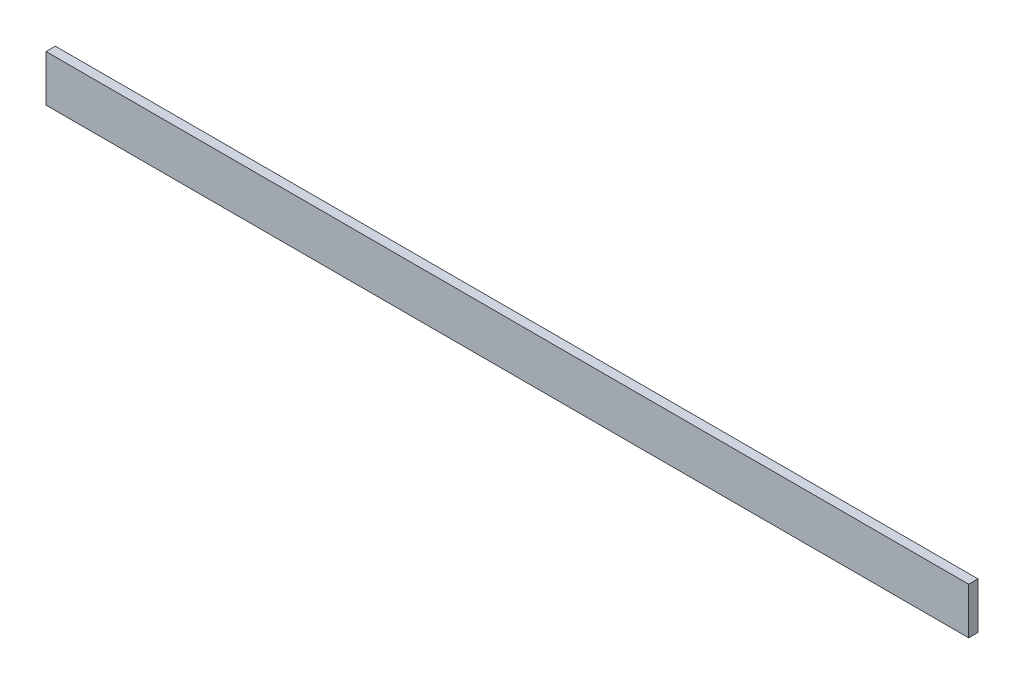
ISO-10303-21;
HEADER;
FILE_DESCRIPTION(('STEP AP214'),'2;1');
FILE_NAME('part.step','',(''),(''),'','','');
FILE_SCHEMA(('AUTOMOTIVE_DESIGN { 1 0 10303 214 1 1 1 1 }'));
ENDSEC;
DATA;
#1=APPLICATION_CONTEXT('core data for automotive mechanical design processes');
#2=APPLICATION_PROTOCOL_DEFINITION('international standard','automotive_design',2000,#1);
#3=PRODUCT_CONTEXT('',#1,'mechanical');
#4=PRODUCT('Part','Part','',(#3));
#5=PRODUCT_RELATED_PRODUCT_CATEGORY('part','',(#4));
#6=PRODUCT_DEFINITION_FORMATION('','',#4);
#7=PRODUCT_DEFINITION_CONTEXT('part definition',#1,'design');
#8=PRODUCT_DEFINITION('design','',#6,#7);
#9=PRODUCT_DEFINITION_SHAPE('','',#8);
#10=(LENGTH_UNIT() NAMED_UNIT(*) SI_UNIT(.MILLI.,.METRE.));
#11=(NAMED_UNIT(*) PLANE_ANGLE_UNIT() SI_UNIT($,.RADIAN.));
#12=(NAMED_UNIT(*) SI_UNIT($,.STERADIAN.) SOLID_ANGLE_UNIT());
#13=UNCERTAINTY_MEASURE_WITH_UNIT(LENGTH_MEASURE(1.E-05),#10,'distance_accuracy_value','');
#14=(GEOMETRIC_REPRESENTATION_CONTEXT(3) GLOBAL_UNCERTAINTY_ASSIGNED_CONTEXT((#13)) GLOBAL_UNIT_ASSIGNED_CONTEXT((#10,
#11,#12)) REPRESENTATION_CONTEXT('',''));
#15=CARTESIAN_POINT('',(0.,0.,0.));
#16=DIRECTION('',(0.,0.,1.));
#17=DIRECTION('',(1.,0.,0.));
#18=AXIS2_PLACEMENT_3D('',#15,#16,#17);
#19=CARTESIAN_POINT('',(-149.,7.5,1.5));
#20=DIRECTION('',(1.,0.,0.));
#21=DIRECTION('',(0.,1.,0.));
#22=AXIS2_PLACEMENT_3D('',#19,#20,#21);
#23=PLANE('',#22);
#24=DIRECTION('',(0.,-1.,0.));
#25=VECTOR('',#24,1.);
#26=CARTESIAN_POINT('',(-149.,7.5,-1.5));
#27=LINE('',#26,#25);
#28=CARTESIAN_POINT('',(-149.,7.5,-1.5));
#29=VERTEX_POINT('',#28);
#30=CARTESIAN_POINT('',(-149.,-7.5,-1.5));
#31=VERTEX_POINT('',#30);
#32=EDGE_CURVE('E77',#29,#31,#27,.T.);
#33=ORIENTED_EDGE('',*,*,#32,.T.);
#34=DIRECTION('',(0.,0.,-1.));
#35=VECTOR('',#34,1.);
#36=CARTESIAN_POINT('',(-149.,-7.5,1.5));
#37=LINE('',#36,#35);
#38=CARTESIAN_POINT('',(-149.,-7.5,1.5));
#39=VERTEX_POINT('',#38);
#40=EDGE_CURVE('E11',#39,#31,#37,.T.);
#41=ORIENTED_EDGE('',*,*,#40,.F.);
#42=DIRECTION('',(0.,-1.,0.));
#43=VECTOR('',#42,1.);
#44=CARTESIAN_POINT('',(-149.,7.5,1.5));
#45=LINE('',#44,#43);
#46=CARTESIAN_POINT('',(-149.,7.5,1.5));
#47=VERTEX_POINT('',#46);
#48=EDGE_CURVE('E95',#47,#39,#45,.T.);
#49=ORIENTED_EDGE('',*,*,#48,.F.);
#50=DIRECTION('',(0.,0.,-1.));
#51=VECTOR('',#50,1.);
#52=CARTESIAN_POINT('',(-149.,7.5,1.5));
#53=LINE('',#52,#51);
#54=EDGE_CURVE('E89',#47,#29,#53,.T.);
#55=ORIENTED_EDGE('',*,*,#54,.T.);
#56=EDGE_LOOP('',(#33,#41,#49,#55));
#57=FACE_BOUND('',#56,.T.);
#58=ADVANCED_FACE('F33',(#57),#23,.F.);
#59=CARTESIAN_POINT('',(-149.,-7.5,1.5));
#60=DIRECTION('',(0.,1.,0.));
#61=DIRECTION('',(-1.,0.,0.));
#62=AXIS2_PLACEMENT_3D('',#59,#60,#61);
#63=PLANE('',#62);
#64=DIRECTION('',(1.,0.,0.));
#65=VECTOR('',#64,1.);
#66=CARTESIAN_POINT('',(-149.,-7.5,-1.5));
#67=LINE('',#66,#65);
#68=CARTESIAN_POINT('',(149.,-7.5,-1.5));
#69=VERTEX_POINT('',#68);
#70=EDGE_CURVE('E73',#31,#69,#67,.T.);
#71=ORIENTED_EDGE('',*,*,#70,.T.);
#72=DIRECTION('',(0.,0.,-1.));
#73=VECTOR('',#72,1.);
#74=CARTESIAN_POINT('',(149.,-7.5,1.5));
#75=LINE('',#74,#73);
#76=CARTESIAN_POINT('',(149.,-7.5,1.5));
#77=VERTEX_POINT('',#76);
#78=EDGE_CURVE('E40',#77,#69,#75,.T.);
#79=ORIENTED_EDGE('',*,*,#78,.F.);
#80=DIRECTION('',(1.,0.,0.));
#81=VECTOR('',#80,1.);
#82=CARTESIAN_POINT('',(-149.,-7.5,1.5));
#83=LINE('',#82,#81);
#84=EDGE_CURVE('E85',#39,#77,#83,.T.);
#85=ORIENTED_EDGE('',*,*,#84,.F.);
#86=ORIENTED_EDGE('',*,*,#40,.T.);
#87=EDGE_LOOP('',(#71,#79,#85,#86));
#88=FACE_BOUND('',#87,.T.);
#89=ADVANCED_FACE('F84',(#88),#63,.F.);
#90=CARTESIAN_POINT('',(149.,7.5,1.5));
#91=DIRECTION('',(-1.,0.,0.));
#92=DIRECTION('',(0.,-1.,0.));
#93=AXIS2_PLACEMENT_3D('',#90,#91,#92);
#94=PLANE('',#93);
#95=DIRECTION('',(0.,1.,0.));
#96=VECTOR('',#95,1.);
#97=CARTESIAN_POINT('',(149.,7.5,-1.5));
#98=LINE('',#97,#96);
#99=CARTESIAN_POINT('',(149.,7.5,-1.5));
#100=VERTEX_POINT('',#99);
#101=EDGE_CURVE('E78',#69,#100,#98,.T.);
#102=ORIENTED_EDGE('',*,*,#101,.T.);
#103=DIRECTION('',(0.,0.,-1.));
#104=VECTOR('',#103,1.);
#105=CARTESIAN_POINT('',(149.,7.5,1.5));
#106=LINE('',#105,#104);
#107=CARTESIAN_POINT('',(149.,7.5,1.5));
#108=VERTEX_POINT('',#107);
#109=EDGE_CURVE('E101',#108,#100,#106,.T.);
#110=ORIENTED_EDGE('',*,*,#109,.F.);
#111=DIRECTION('',(0.,1.,0.));
#112=VECTOR('',#111,1.);
#113=CARTESIAN_POINT('',(149.,7.5,1.5));
#114=LINE('',#113,#112);
#115=EDGE_CURVE('E52',#77,#108,#114,.T.);
#116=ORIENTED_EDGE('',*,*,#115,.F.);
#117=ORIENTED_EDGE('',*,*,#78,.T.);
#118=EDGE_LOOP('',(#102,#110,#116,#117));
#119=FACE_BOUND('',#118,.T.);
#120=ADVANCED_FACE('F104',(#119),#94,.F.);
#121=CARTESIAN_POINT('',(-149.,7.5,1.5));
#122=DIRECTION('',(0.,-1.,0.));
#123=DIRECTION('',(0.,0.,-1.));
#124=AXIS2_PLACEMENT_3D('',#121,#122,#123);
#125=PLANE('',#124);
#126=DIRECTION('',(-1.,0.,0.));
#127=VECTOR('',#126,1.);
#128=CARTESIAN_POINT('',(-149.,7.5,-1.5));
#129=LINE('',#128,#127);
#130=EDGE_CURVE('E93',#100,#29,#129,.T.);
#131=ORIENTED_EDGE('',*,*,#130,.T.);
#132=ORIENTED_EDGE('',*,*,#54,.F.);
#133=DIRECTION('',(-1.,0.,0.));
#134=VECTOR('',#133,1.);
#135=CARTESIAN_POINT('',(-149.,7.5,1.5));
#136=LINE('',#135,#134);
#137=EDGE_CURVE('E47',#108,#47,#136,.T.);
#138=ORIENTED_EDGE('',*,*,#137,.F.);
#139=ORIENTED_EDGE('',*,*,#109,.T.);
#140=EDGE_LOOP('',(#131,#132,#138,#139));
#141=FACE_BOUND('',#140,.T.);
#142=ADVANCED_FACE('F106',(#141),#125,.F.);
#143=CARTESIAN_POINT('',(-149.,7.5,1.5));
#144=DIRECTION('',(0.,0.,1.));
#145=DIRECTION('',(1.,0.,0.));
#146=AXIS2_PLACEMENT_3D('',#143,#144,#145);
#147=PLANE('',#146);
#148=ORIENTED_EDGE('',*,*,#48,.T.);
#149=ORIENTED_EDGE('',*,*,#84,.T.);
#150=ORIENTED_EDGE('',*,*,#115,.T.);
#151=ORIENTED_EDGE('',*,*,#137,.T.);
#152=EDGE_LOOP('',(#148,#149,#150,#151));
#153=FACE_BOUND('',#152,.T.);
#154=ADVANCED_FACE('F107',(#153),#147,.T.);
#155=CARTESIAN_POINT('',(-149.,7.5,-1.5));
#156=DIRECTION('',(0.,0.,1.));
#157=DIRECTION('',(1.,0.,0.));
#158=AXIS2_PLACEMENT_3D('',#155,#156,#157);
#159=PLANE('',#158);
#160=ORIENTED_EDGE('',*,*,#32,.F.);
#161=ORIENTED_EDGE('',*,*,#130,.F.);
#162=ORIENTED_EDGE('',*,*,#101,.F.);
#163=ORIENTED_EDGE('',*,*,#70,.F.);
#164=EDGE_LOOP('',(#160,#161,#162,#163));
#165=FACE_BOUND('',#164,.T.);
#166=ADVANCED_FACE('F74',(#165),#159,.F.);
#167=CLOSED_SHELL('',(#58,#89,#120,#142,#154,#166));
#168=MANIFOLD_SOLID_BREP('B2',#167);
#169=ADVANCED_BREP_SHAPE_REPRESENTATION('',(#18,#168),#14);
#170=SHAPE_DEFINITION_REPRESENTATION(#9,#169);
ENDSEC;
END-ISO-10303-21;
